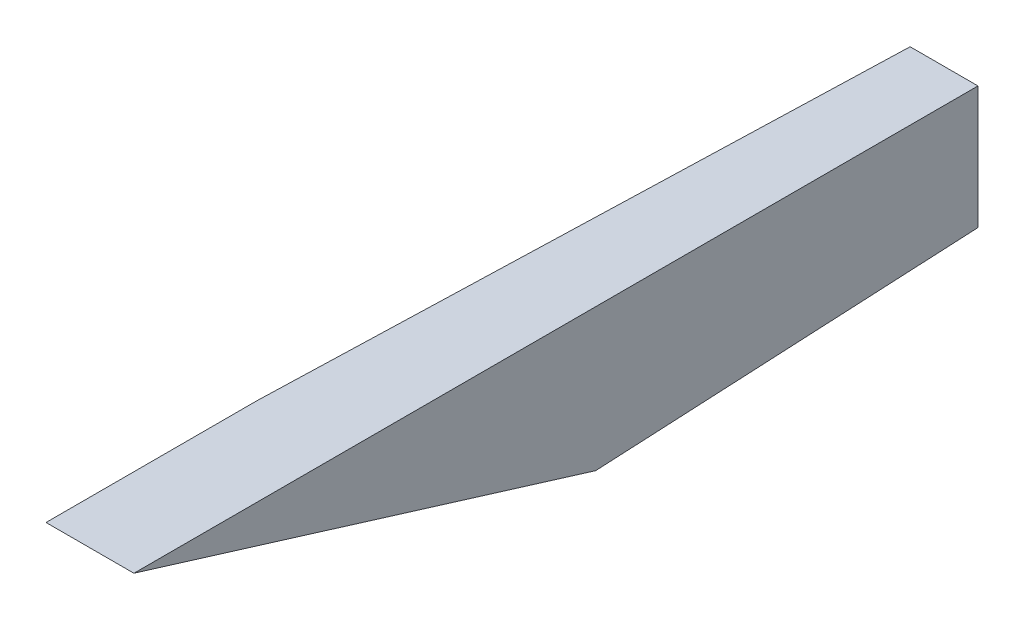
ISO-10303-21;
HEADER;
FILE_DESCRIPTION(('STEP AP214'),'2;1');
FILE_NAME('part.step','',(''),(''),'','','');
FILE_SCHEMA(('AUTOMOTIVE_DESIGN { 1 0 10303 214 1 1 1 1 }'));
ENDSEC;
DATA;
#1=APPLICATION_CONTEXT('core data for automotive mechanical design processes');
#2=APPLICATION_PROTOCOL_DEFINITION('international standard','automotive_design',2000,#1);
#3=PRODUCT_CONTEXT('',#1,'mechanical');
#4=PRODUCT('Part','Part','',(#3));
#5=PRODUCT_RELATED_PRODUCT_CATEGORY('part','',(#4));
#6=PRODUCT_DEFINITION_FORMATION('','',#4);
#7=PRODUCT_DEFINITION_CONTEXT('part definition',#1,'design');
#8=PRODUCT_DEFINITION('design','',#6,#7);
#9=PRODUCT_DEFINITION_SHAPE('','',#8);
#10=(LENGTH_UNIT() NAMED_UNIT(*) SI_UNIT(.MILLI.,.METRE.));
#11=(NAMED_UNIT(*) PLANE_ANGLE_UNIT() SI_UNIT($,.RADIAN.));
#12=(NAMED_UNIT(*) SI_UNIT($,.STERADIAN.) SOLID_ANGLE_UNIT());
#13=UNCERTAINTY_MEASURE_WITH_UNIT(LENGTH_MEASURE(1.E-05),#10,'distance_accuracy_value','');
#14=(GEOMETRIC_REPRESENTATION_CONTEXT(3) GLOBAL_UNCERTAINTY_ASSIGNED_CONTEXT((#13)) GLOBAL_UNIT_ASSIGNED_CONTEXT((#10,
#11,#12)) REPRESENTATION_CONTEXT('',''));
#15=CARTESIAN_POINT('',(0.,0.,0.));
#16=DIRECTION('',(0.,0.,1.));
#17=DIRECTION('',(1.,0.,0.));
#18=AXIS2_PLACEMENT_3D('',#15,#16,#17);
#19=CARTESIAN_POINT('',(0.,0.,-584.2));
#20=DIRECTION('',(0.,0.,1.));
#21=DIRECTION('',(1.,0.,0.));
#22=AXIS2_PLACEMENT_3D('',#19,#20,#21);
#23=PLANE('',#22);
#24=DIRECTION('',(0.,-1.,0.));
#25=VECTOR('',#24,1.);
#26=CARTESIAN_POINT('',(-18.161,0.,-584.2));
#27=LINE('',#26,#25);
#28=CARTESIAN_POINT('',(-18.161,5.96900000000002,-584.2));
#29=VERTEX_POINT('',#28);
#30=CARTESIAN_POINT('',(-18.161,-38.3259162166958,-584.2));
#31=VERTEX_POINT('',#30);
#32=EDGE_CURVE('E48',#29,#31,#27,.T.);
#33=ORIENTED_EDGE('',*,*,#32,.T.);
#34=DIRECTION('',(1.,0.,0.));
#35=VECTOR('',#34,1.);
#36=CARTESIAN_POINT('',(0.,-38.3259162166958,-584.2));
#37=LINE('',#36,#35);
#38=CARTESIAN_POINT('',(-29.9843258252833,-38.3259162166958,-584.2));
#39=VERTEX_POINT('',#38);
#40=EDGE_CURVE('E140',#39,#31,#37,.T.);
#41=ORIENTED_EDGE('',*,*,#40,.F.);
#42=CARTESIAN_POINT('',(-29.9639479786131,-25.6096034762046,-584.2));
#43=DIRECTION('',(0.,0.,1.));
#44=DIRECTION('',(-0.52999894000318,-0.847998304005088,0.));
#45=AXIS2_PLACEMENT_3D('',#42,#43,#44);
#46=ELLIPSE('',#45,12.7226792238703,12.7);
#47=CARTESIAN_POINT('',(-42.6703226354349,-25.6299972610752,-584.2));
#48=VERTEX_POINT('',#47);
#49=EDGE_CURVE('E11',#39,#48,#46,.F.);
#50=ORIENTED_EDGE('',*,*,#49,.T.);
#51=DIRECTION('',(0.,-1.,0.));
#52=VECTOR('',#51,1.);
#53=CARTESIAN_POINT('',(-42.6703226354349,0.,-584.2));
#54=LINE('',#53,#52);
#55=CARTESIAN_POINT('',(-42.6703226354349,5.96900000000002,-584.2));
#56=VERTEX_POINT('',#55);
#57=EDGE_CURVE('E60',#56,#48,#54,.T.);
#58=ORIENTED_EDGE('',*,*,#57,.F.);
#59=DIRECTION('',(1.,0.,0.));
#60=VECTOR('',#59,1.);
#61=CARTESIAN_POINT('',(0.,5.96900000000002,-584.2));
#62=LINE('',#61,#60);
#63=EDGE_CURVE('E104',#56,#29,#62,.T.);
#64=ORIENTED_EDGE('',*,*,#63,.T.);
#65=EDGE_LOOP('',(#33,#41,#50,#58,#64));
#66=FACE_BOUND('',#65,.T.);
#67=ADVANCED_FACE('F45',(#66),#23,.F.);
#68=CARTESIAN_POINT('',(-49.921,5.96900771473894,-279.4));
#69=DIRECTION('',(0.,0.955805662169999,-0.293999211161814));
#70=DIRECTION('',(0.,0.293999211161814,0.95580566217));
#71=AXIS2_PLACEMENT_3D('',#68,#69,#70);
#72=PLANE('',#71);
#73=DIRECTION('',(0.,0.293999211161814,0.95580566217));
#74=VECTOR('',#73,1.);
#75=CARTESIAN_POINT('',(-18.161,83.9661806626817,-25.8274164468259));
#76=LINE('',#75,#74);
#77=CARTESIAN_POINT('',(-18.161,-45.324750584507,-446.158490346475));
#78=VERTEX_POINT('',#77);
#79=CARTESIAN_POINT('',(-18.161,5.96900000000002,-279.40002508099));
#80=VERTEX_POINT('',#79);
#81=EDGE_CURVE('E136',#78,#80,#76,.T.);
#82=ORIENTED_EDGE('',*,*,#81,.T.);
#83=DIRECTION('',(-1.,0.,0.));
#84=VECTOR('',#83,1.);
#85=CARTESIAN_POINT('',(0.,5.96900000000002,-279.40002508099));
#86=LINE('',#85,#84);
#87=CARTESIAN_POINT('',(-49.911,5.96900000000002,-279.40002508099));
#88=VERTEX_POINT('',#87);
#89=EDGE_CURVE('E158',#80,#88,#86,.T.);
#90=ORIENTED_EDGE('',*,*,#89,.T.);
#91=DIRECTION('',(0.,0.293999211161814,0.95580566217));
#92=VECTOR('',#91,1.);
#93=CARTESIAN_POINT('',(-49.911,86.7896518290421,-16.648175056632));
#94=LINE('',#93,#92);
#95=CARTESIAN_POINT('',(-49.911,-17.5008367298469,-355.7016));
#96=VERTEX_POINT('',#95);
#97=EDGE_CURVE('E117',#96,#88,#94,.T.);
#98=ORIENTED_EDGE('',*,*,#97,.F.);
#99=DIRECTION('',(-0.0302737712385389,0.293864454960091,0.955367563237315));
#100=VECTOR('',#99,1.);
#101=CARTESIAN_POINT('',(-60.3087583408269,83.4291585310044,-27.5733013835216));
#102=LINE('',#101,#100);
#103=CARTESIAN_POINT('',(-48.1674411834575,-34.4253869379114,-410.72413170892));
#104=VERTEX_POINT('',#103);
#105=EDGE_CURVE('E110',#104,#96,#102,.T.);
#106=ORIENTED_EDGE('',*,*,#105,.F.);
#107=CARTESIAN_POINT('',(-35.4628701850893,-34.4078790065666,-410.667212576906));
#108=DIRECTION('',(0.,0.955805662169999,-0.293999211161814));
#109=DIRECTION('',(-0.0336594162159992,0.293832619834028,0.955264065701977));
#110=AXIS2_PLACEMENT_3D('',#107,#108,#109);
#111=ELLIPSE('',#110,37.1509063553258,12.7);
#112=CARTESIAN_POINT('',(-34.3585973051653,-45.324750584507,-446.158490346475));
#113=VERTEX_POINT('',#112);
#114=EDGE_CURVE('E127',#104,#113,#111,.F.);
#115=ORIENTED_EDGE('',*,*,#114,.T.);
#116=DIRECTION('',(1.,0.,0.));
#117=VECTOR('',#116,1.);
#118=CARTESIAN_POINT('',(-49.921,-45.324750584507,-446.158490346475));
#119=LINE('',#118,#117);
#120=EDGE_CURVE('E151',#113,#78,#119,.T.);
#121=ORIENTED_EDGE('',*,*,#120,.T.);
#122=EDGE_LOOP('',(#82,#90,#98,#106,#115,#121));
#123=FACE_BOUND('',#122,.T.);
#124=ADVANCED_FACE('F156',(#123),#72,.F.);
#125=CARTESIAN_POINT('',(0.,5.96900000000002,0.));
#126=DIRECTION('',(0.,1.,0.));
#127=DIRECTION('',(0.,0.,1.));
#128=AXIS2_PLACEMENT_3D('',#125,#126,#127);
#129=PLANE('',#128);
#130=ORIENTED_EDGE('',*,*,#63,.F.);
#131=DIRECTION('',(-0.0316721902279268,0.,0.999498310336824));
#132=VECTOR('',#131,1.);
#133=CARTESIAN_POINT('',(-61.1211296763861,5.96900000000002,-1.93681172447797));
#134=LINE('',#133,#132);
#135=CARTESIAN_POINT('',(-49.911,5.96900000000002,-355.7016));
#136=VERTEX_POINT('',#135);
#137=EDGE_CURVE('E97',#56,#136,#134,.T.);
#138=ORIENTED_EDGE('',*,*,#137,.T.);
#139=DIRECTION('',(0.,0.,1.));
#140=VECTOR('',#139,1.);
#141=CARTESIAN_POINT('',(-49.911,5.96900000000002,25.4));
#142=LINE('',#141,#140);
#143=EDGE_CURVE('E102',#136,#88,#142,.T.);
#144=ORIENTED_EDGE('',*,*,#143,.T.);
#145=ORIENTED_EDGE('',*,*,#89,.F.);
#146=DIRECTION('',(0.,0.,1.));
#147=VECTOR('',#146,1.);
#148=CARTESIAN_POINT('',(-18.161,5.96900000000002,0.));
#149=LINE('',#148,#147);
#150=EDGE_CURVE('E114',#29,#80,#149,.T.);
#151=ORIENTED_EDGE('',*,*,#150,.F.);
#152=EDGE_LOOP('',(#130,#138,#144,#145,#151));
#153=FACE_BOUND('',#152,.T.);
#154=ADVANCED_FACE('F99',(#153),#129,.T.);
#155=CARTESIAN_POINT('',(-49.911,-49.911,25.4));
#156=DIRECTION('',(1.,0.,0.));
#157=DIRECTION('',(0.,0.,-1.));
#158=AXIS2_PLACEMENT_3D('',#155,#156,#157);
#159=PLANE('',#158);
#160=DIRECTION('',(0.,1.,0.));
#161=VECTOR('',#160,1.);
#162=CARTESIAN_POINT('',(-49.911,-49.911,-355.7016));
#163=LINE('',#162,#161);
#164=EDGE_CURVE('E107',#136,#96,#163,.F.);
#165=ORIENTED_EDGE('',*,*,#164,.T.);
#166=ORIENTED_EDGE('',*,*,#97,.T.);
#167=ORIENTED_EDGE('',*,*,#143,.F.);
#168=EDGE_LOOP('',(#165,#166,#167));
#169=FACE_BOUND('',#168,.T.);
#170=ADVANCED_FACE('F116',(#169),#159,.F.);
#171=CARTESIAN_POINT('',(0.,-67.7711940185204,-3.43606327571275));
#172=DIRECTION('',(0.,0.998717179985735,0.0506359003212277));
#173=DIRECTION('',(0.,-0.0506359003212277,0.998717179985735));
#174=AXIS2_PLACEMENT_3D('',#171,#172,#173);
#175=PLANE('',#174);
#176=DIRECTION('',(-0.0316316011868878,-0.0506105618990205,0.99821741761533));
#177=VECTOR('',#176,1.);
#178=CARTESIAN_POINT('',(-48.3392098173077,-67.6937306039349,-4.96391293329035));
#179=LINE('',#178,#177);
#180=EDGE_CURVE('E113',#113,#39,#179,.F.);
#181=ORIENTED_EDGE('',*,*,#180,.T.);
#182=ORIENTED_EDGE('',*,*,#40,.T.);
#183=DIRECTION('',(0.,0.0506359003212277,-0.998717179985735));
#184=VECTOR('',#183,1.);
#185=CARTESIAN_POINT('',(-18.161,-67.7711940185204,-3.43606327571275));
#186=LINE('',#185,#184);
#187=EDGE_CURVE('E131',#78,#31,#186,.T.);
#188=ORIENTED_EDGE('',*,*,#187,.F.);
#189=ORIENTED_EDGE('',*,*,#120,.F.);
#190=EDGE_LOOP('',(#181,#182,#188,#189));
#191=FACE_BOUND('',#190,.T.);
#192=ADVANCED_FACE('F150',(#191),#175,.F.);
#193=CARTESIAN_POINT('',(-18.161,0.,0.));
#194=DIRECTION('',(1.,0.,0.));
#195=DIRECTION('',(0.,0.,-1.));
#196=AXIS2_PLACEMENT_3D('',#193,#194,#195);
#197=PLANE('',#196);
#198=ORIENTED_EDGE('',*,*,#32,.F.);
#199=ORIENTED_EDGE('',*,*,#150,.T.);
#200=ORIENTED_EDGE('',*,*,#81,.F.);
#201=ORIENTED_EDGE('',*,*,#187,.T.);
#202=EDGE_LOOP('',(#198,#199,#200,#201));
#203=FACE_BOUND('',#202,.T.);
#204=ADVANCED_FACE('F147',(#203),#197,.T.);
#205=CARTESIAN_POINT('',(-61.1211296763861,0.,-1.93681172447797));
#206=DIRECTION('',(0.999498310336824,0.,0.0316721902279268));
#207=DIRECTION('',(0.0316721902279268,0.,-0.999498310336824));
#208=AXIS2_PLACEMENT_3D('',#205,#206,#207);
#209=PLANE('',#208);
#210=ORIENTED_EDGE('',*,*,#137,.F.);
#211=ORIENTED_EDGE('',*,*,#57,.T.);
#212=DIRECTION('',(-0.0316316011868878,-0.0506105618990205,0.998217417615331));
#213=VECTOR('',#212,1.);
#214=CARTESIAN_POINT('',(-61.0328383585854,-55.010022418116,-4.72307381510543));
#215=LINE('',#214,#213);
#216=EDGE_CURVE('E126',#48,#104,#215,.T.);
#217=ORIENTED_EDGE('',*,*,#216,.T.);
#218=ORIENTED_EDGE('',*,*,#105,.T.);
#219=ORIENTED_EDGE('',*,*,#164,.F.);
#220=EDGE_LOOP('',(#210,#211,#217,#218,#219));
#221=FACE_BOUND('',#220,.T.);
#222=ADVANCED_FACE('F108',(#221),#209,.F.);
#223=CARTESIAN_POINT('',(-48.3392098173077,-55.010022418116,-4.32083699921076));
#224=DIRECTION('',(-0.0316316011868878,-0.0506105618990205,0.99821741761533));
#225=DIRECTION('',(0.,-0.998717179985735,-0.0506359003212277));
#226=AXIS2_PLACEMENT_3D('',#223,#224,#225);
#227=CYLINDRICAL_SURFACE('',#226,12.7);
#228=ORIENTED_EDGE('',*,*,#49,.F.);
#229=ORIENTED_EDGE('',*,*,#180,.F.);
#230=ORIENTED_EDGE('',*,*,#114,.F.);
#231=ORIENTED_EDGE('',*,*,#216,.F.);
#232=EDGE_LOOP('',(#228,#229,#230,#231));
#233=FACE_BOUND('',#232,.T.);
#234=ADVANCED_FACE('F154',(#233),#227,.T.);
#235=CLOSED_SHELL('',(#67,#124,#154,#170,#192,#204,#222,#234));
#236=MANIFOLD_SOLID_BREP('B2',#235);
#237=ADVANCED_BREP_SHAPE_REPRESENTATION('',(#18,#236),#14);
#238=SHAPE_DEFINITION_REPRESENTATION(#9,#237);
ENDSEC;
END-ISO-10303-21;
